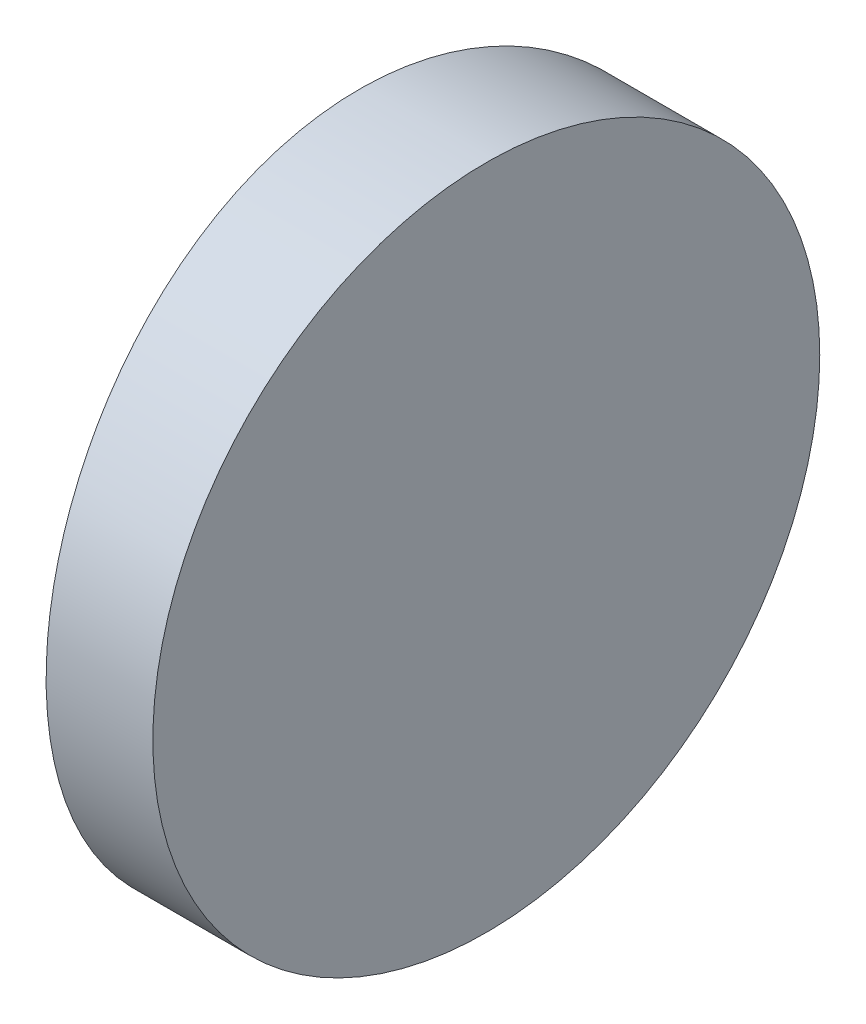
ISO-10303-21;
HEADER;
FILE_DESCRIPTION(('STEP AP214'),'2;1');
FILE_NAME('part.step','',(''),(''),'','','');
FILE_SCHEMA(('AUTOMOTIVE_DESIGN { 1 0 10303 214 1 1 1 1 }'));
ENDSEC;
DATA;
#1=APPLICATION_CONTEXT('core data for automotive mechanical design processes');
#2=APPLICATION_PROTOCOL_DEFINITION('international standard','automotive_design',2000,#1);
#3=PRODUCT_CONTEXT('',#1,'mechanical');
#4=PRODUCT('Part','Part','',(#3));
#5=PRODUCT_RELATED_PRODUCT_CATEGORY('part','',(#4));
#6=PRODUCT_DEFINITION_FORMATION('','',#4);
#7=PRODUCT_DEFINITION_CONTEXT('part definition',#1,'design');
#8=PRODUCT_DEFINITION('design','',#6,#7);
#9=PRODUCT_DEFINITION_SHAPE('','',#8);
#10=(LENGTH_UNIT() NAMED_UNIT(*) SI_UNIT(.MILLI.,.METRE.));
#11=(NAMED_UNIT(*) PLANE_ANGLE_UNIT() SI_UNIT($,.RADIAN.));
#12=(NAMED_UNIT(*) SI_UNIT($,.STERADIAN.) SOLID_ANGLE_UNIT());
#13=UNCERTAINTY_MEASURE_WITH_UNIT(LENGTH_MEASURE(1.E-05),#10,'distance_accuracy_value','');
#14=(GEOMETRIC_REPRESENTATION_CONTEXT(3) GLOBAL_UNCERTAINTY_ASSIGNED_CONTEXT((#13)) GLOBAL_UNIT_ASSIGNED_CONTEXT((#10,
#11,#12)) REPRESENTATION_CONTEXT('',''));
#15=CARTESIAN_POINT('',(0.,0.,0.));
#16=DIRECTION('',(0.,0.,1.));
#17=DIRECTION('',(1.,0.,0.));
#18=AXIS2_PLACEMENT_3D('',#15,#16,#17);
#19=CARTESIAN_POINT('',(4.35520433485127,12.5,0.));
#20=DIRECTION('',(0.,-1.,0.));
#21=DIRECTION('',(0.,0.,-1.));
#22=AXIS2_PLACEMENT_3D('',#19,#20,#21);
#23=CYLINDRICAL_SURFACE('',#22,51.68);
#24=CARTESIAN_POINT('',(-47.3247956651487,0.,0.));
#25=CARTESIAN_POINT('',(-47.3247962748539,-1.87657376567056E-06,-0.174906669645509));
#26=CARTESIAN_POINT('',(-47.3239059609,0.00734487603199729,-0.349785369305593));
#27=CARTESIAN_POINT('',(-47.3203708691074,0.036676047696006,-0.698348805374822));
#28=CARTESIAN_POINT('',(-47.3177256824529,0.0586638775502908,-0.872033254042626));
#29=CARTESIAN_POINT('',(-47.3107516572461,0.117141965164515,-1.21704271353615));
#30=CARTESIAN_POINT('',(-47.3064215199131,0.153643410673644,-1.38836579845842));
#31=CARTESIAN_POINT('',(-47.2961981459277,0.240894026508214,-1.72736463651157));
#32=CARTESIAN_POINT('',(-47.290304336173,0.291648421089333,-1.89503902792816));
#33=CARTESIAN_POINT('',(-47.2771271049913,0.406967847521387,-2.22531800216002));
#34=CARTESIAN_POINT('',(-47.269845119434,0.471518617278257,-2.38792762331963));
#35=CARTESIAN_POINT('',(-47.2540888707698,0.614021061676128,-2.70717743777051));
#36=CARTESIAN_POINT('',(-47.2456141626998,0.691977740011487,-2.86381537539246));
#37=CARTESIAN_POINT('',(-47.2277174619798,0.860663622669466,-3.16986831518064));
#38=CARTESIAN_POINT('',(-47.2182960731656,0.95138469987586,-3.31928783263471));
#39=CARTESIAN_POINT('',(-47.1987600662448,1.14503909034646,-3.61004128740635));
#40=CARTESIAN_POINT('',(-47.1886451350493,1.24797793466184,-3.75137151941614));
#41=CARTESIAN_POINT('',(-47.1679614378123,1.46580567637174,-4.0255153519705));
#42=CARTESIAN_POINT('',(-47.1573908266681,1.58074649773508,-4.15828755852108));
#43=CARTESIAN_POINT('',(-47.1361412731896,1.82132988943045,-4.41363089308497));
#44=CARTESIAN_POINT('',(-47.1254623814721,1.94696764572813,-4.53620656134385));
#45=CARTESIAN_POINT('',(-47.1042852735789,2.20820256904601,-4.77044782514803));
#46=CARTESIAN_POINT('',(-47.093787185761,2.34380647848065,-4.88210591335319));
#47=CARTESIAN_POINT('',(-47.0732800476863,2.62389983321886,-5.09359214730054));
#48=CARTESIAN_POINT('',(-47.0632708159094,2.76838593471542,-5.19342470397805));
#49=CARTESIAN_POINT('',(-47.0439830603866,3.06587091656297,-5.38097214648882));
#50=CARTESIAN_POINT('',(-47.0347075872112,3.21890124179908,-5.46863748071654));
#51=CARTESIAN_POINT('',(-47.0172013506604,3.53181009945843,-5.63071745196715));
#52=CARTESIAN_POINT('',(-47.0089702038538,3.69168608944739,-5.70513695634883));
#53=CARTESIAN_POINT('',(-46.9937923159281,4.0170785965597,-5.84016789857392));
#54=CARTESIAN_POINT('',(-46.9868445425022,4.18259045231382,-5.90079044346387));
#55=CARTESIAN_POINT('',(-46.9744277294168,4.51813759520515,-6.00784225000146));
#56=CARTESIAN_POINT('',(-46.9689583323218,4.68817177801411,-6.05427494276512));
#57=CARTESIAN_POINT('',(-46.9581400840799,5.08761265149082,-6.14539427822699));
#58=CARTESIAN_POINT('',(-46.9534112156761,5.31831233762327,-6.18458207306526));
#59=CARTESIAN_POINT('',(-46.947080076089,5.78269133175732,-6.23688359194108));
#60=CARTESIAN_POINT('',(-46.9454777837787,6.01637061961435,-6.24999749216573));
#61=CARTESIAN_POINT('',(-46.9454763208697,6.42490141151197,-6.25000187743402));
#62=CARTESIAN_POINT('',(-46.9463732197534,6.59977485271389,-6.24265556229403));
#63=CARTESIAN_POINT('',(-46.9499338694338,6.94832763015294,-6.21332618071064));
#64=CARTESIAN_POINT('',(-46.952598032015,7.12200667855671,-6.1913397030044));
#65=CARTESIAN_POINT('',(-46.9596202899006,7.46700521516011,-6.13286531527865));
#66=CARTESIAN_POINT('',(-46.9639796928088,7.6383227759744,-6.09636621062255));
#67=CARTESIAN_POINT('',(-46.9742685717104,7.97731045016011,-6.00912137160231));
#68=CARTESIAN_POINT('',(-46.9801986234784,8.1449792014945,-5.95837041232503));
#69=CARTESIAN_POINT('',(-46.9934511442764,8.47524618164766,-5.84305928171238));
#70=CARTESIAN_POINT('',(-47.0007721673958,8.63784947348723,-5.77851344149129));
#71=CARTESIAN_POINT('',(-47.0166049828427,8.95708717682365,-5.63602205206217));
#72=CARTESIAN_POINT('',(-47.0251172195852,9.11371933274545,-5.55807149936218));
#73=CARTESIAN_POINT('',(-47.0430832372052,9.41976174698812,-5.38939880534517));
#74=CARTESIAN_POINT('',(-47.0525364183052,9.56917651673221,-5.29868478466711));
#75=CARTESIAN_POINT('',(-47.0721267666286,9.85992179077867,-5.10504515470323));
#76=CARTESIAN_POINT('',(-47.0822642427497,10.001248590175,-5.00211401436884));
#77=CARTESIAN_POINT('',(-47.1029820938264,10.2753971907703,-4.78429395996451));
#78=CARTESIAN_POINT('',(-47.1135642898415,10.4081769280225,-4.66935227377387));
#79=CARTESIAN_POINT('',(-47.1348239050727,10.6635353751031,-4.42876556446081));
#80=CARTESIAN_POINT('',(-47.1455012795352,10.7861186254391,-4.30312535639076));
#81=CARTESIAN_POINT('',(-47.1666624247846,11.0203747289099,-4.04188401804455));
#82=CARTESIAN_POINT('',(-47.1771460585783,11.1320400847039,-3.9062761533584));
#83=CARTESIAN_POINT('',(-47.1976129898006,11.3435402724575,-3.62617341779464));
#84=CARTESIAN_POINT('',(-47.2075964730262,11.4433795166925,-3.48168189213455));
#85=CARTESIAN_POINT('',(-47.2268236982851,11.6309344945106,-3.18419266832472));
#86=CARTESIAN_POINT('',(-47.2360643974046,11.7186013319916,-3.03116393900715));
#87=CARTESIAN_POINT('',(-47.2534966303056,11.8806844803813,-2.7182581587774));
#88=CARTESIAN_POINT('',(-47.2616885491524,11.9551056584438,-2.55838365026649));
#89=CARTESIAN_POINT('',(-47.276788001021,12.0901400720557,-2.23299413171391));
#90=CARTESIAN_POINT('',(-47.2836965653819,12.1507644040313,-2.06748377848665));
#91=CARTESIAN_POINT('',(-47.2960394028831,12.2578198667936,-1.73193994905944));
#92=CARTESIAN_POINT('',(-47.3014740321972,12.3042544268587,-1.56190757652231));
#93=CARTESIAN_POINT('',(-47.3122216691637,12.3953819991299,-1.16245519172256));
#94=CARTESIAN_POINT('',(-47.3169176904204,12.4345744222824,-0.93174189828844));
#95=CARTESIAN_POINT('',(-47.3232042709591,12.4868820834596,-0.467335753587004));
#96=CARTESIAN_POINT('',(-47.3247948506956,12.4999974932449,-0.233642921955116));
#97=CARTESIAN_POINT('',(-47.3247962748539,12.5000018765738,0.17490666964555));
#98=CARTESIAN_POINT('',(-47.3239059609,12.492655123968,0.349785369305634));
#99=CARTESIAN_POINT('',(-47.3203708691074,12.463323952304,0.698348805374862));
#100=CARTESIAN_POINT('',(-47.3177256824529,12.4413361224497,0.872033254042665));
#101=CARTESIAN_POINT('',(-47.3107516572461,12.3828580348355,1.21704271353619));
#102=CARTESIAN_POINT('',(-47.3064215199131,12.3463565893264,1.38836579845846));
#103=CARTESIAN_POINT('',(-47.2961981459277,12.2591059734918,1.72736463651161));
#104=CARTESIAN_POINT('',(-47.290304336173,12.2083515789107,1.8950390279282));
#105=CARTESIAN_POINT('',(-47.2771271049913,12.0930321524786,2.22531800216006));
#106=CARTESIAN_POINT('',(-47.269845119434,12.0284813827217,2.38792762331967));
#107=CARTESIAN_POINT('',(-47.2540888707698,11.8859789383239,2.70717743777055));
#108=CARTESIAN_POINT('',(-47.2456141626998,11.8080222599885,2.8638153753925));
#109=CARTESIAN_POINT('',(-47.2277174619797,11.6393363773305,3.16986831518068));
#110=CARTESIAN_POINT('',(-47.2182960731656,11.5486153001241,3.31928783263475));
#111=CARTESIAN_POINT('',(-47.1987600662448,11.3549609096535,3.61004128740639));
#112=CARTESIAN_POINT('',(-47.1886451350493,11.2520220653382,3.75137151941618));
#113=CARTESIAN_POINT('',(-47.1679614378123,11.0341943236283,4.02551535197054));
#114=CARTESIAN_POINT('',(-47.1573908266681,10.9192535022649,4.15828755852112));
#115=CARTESIAN_POINT('',(-47.1361412731896,10.6786701105696,4.41363089308501));
#116=CARTESIAN_POINT('',(-47.1254623814721,10.5530323542719,4.53620656134389));
#117=CARTESIAN_POINT('',(-47.1042852735789,10.291797430954,4.77044782514807));
#118=CARTESIAN_POINT('',(-47.093787185761,10.1561935215194,4.88210591335323));
#119=CARTESIAN_POINT('',(-47.0732800476862,9.87610016678114,5.09359214730058));
#120=CARTESIAN_POINT('',(-47.0632708159094,9.73161406528459,5.19342470397809));
#121=CARTESIAN_POINT('',(-47.0439830603866,9.43412908343703,5.38097214648886));
#122=CARTESIAN_POINT('',(-47.0347075872112,9.28109875820092,5.46863748071658));
#123=CARTESIAN_POINT('',(-47.0172013506604,8.96818990054157,5.63071745196719));
#124=CARTESIAN_POINT('',(-47.0089702038538,8.80831391055261,5.70513695634887));
#125=CARTESIAN_POINT('',(-46.9937923159281,8.4829214034403,5.84016789857397));
#126=CARTESIAN_POINT('',(-46.9868445425022,8.31740954768618,5.90079044346391));
#127=CARTESIAN_POINT('',(-46.9744277294168,7.98186240479485,6.0078422500015));
#128=CARTESIAN_POINT('',(-46.9689583323218,7.81182822198589,6.05427494276516));
#129=CARTESIAN_POINT('',(-46.9581400840799,7.41238734850918,6.14539427822703));
#130=CARTESIAN_POINT('',(-46.9534112156761,7.18168766237673,6.1845820730653));
#131=CARTESIAN_POINT('',(-46.947080076089,6.71730866824268,6.23688359194112));
#132=CARTESIAN_POINT('',(-46.9454777837787,6.48362938038566,6.24999749216577));
#133=CARTESIAN_POINT('',(-46.9454763208697,6.07509858848803,6.25000187743406));
#134=CARTESIAN_POINT('',(-46.9463732197534,5.90022514728612,6.24265556229407));
#135=CARTESIAN_POINT('',(-46.9499338694338,5.55167236984707,6.21332618071068));
#136=CARTESIAN_POINT('',(-46.952598032015,5.37799332144329,6.19133970300444));
#137=CARTESIAN_POINT('',(-46.9596202899006,5.03299478483989,6.1328653152787));
#138=CARTESIAN_POINT('',(-46.9639796928088,4.8616772240256,6.09636621062259));
#139=CARTESIAN_POINT('',(-46.9742685717104,4.52268954983989,6.00912137160235));
#140=CARTESIAN_POINT('',(-46.9801986234784,4.3550207985055,5.95837041232508));
#141=CARTESIAN_POINT('',(-46.9934511442764,4.02475381835234,5.84305928171242));
#142=CARTESIAN_POINT('',(-47.0007721673958,3.86215052651278,5.77851344149133));
#143=CARTESIAN_POINT('',(-47.0166049828427,3.54291282317636,5.63602205206222));
#144=CARTESIAN_POINT('',(-47.0251172195852,3.38628066725455,5.55807149936222));
#145=CARTESIAN_POINT('',(-47.0430832372052,3.08023825301188,5.38939880534521));
#146=CARTESIAN_POINT('',(-47.0525364183052,2.93082348326779,5.29868478466715));
#147=CARTESIAN_POINT('',(-47.0721267666286,2.64007820922133,5.10504515470327));
#148=CARTESIAN_POINT('',(-47.0822642427497,2.49875140982496,5.00211401436888));
#149=CARTESIAN_POINT('',(-47.1029820938264,2.22460280922971,4.78429395996456));
#150=CARTESIAN_POINT('',(-47.1135642898415,2.0918230719775,4.66935227377391));
#151=CARTESIAN_POINT('',(-47.1348239050727,1.83646462489688,4.42876556446085));
#152=CARTESIAN_POINT('',(-47.1455012795352,1.71388137456089,4.3031253563908));
#153=CARTESIAN_POINT('',(-47.1666624247846,1.47962527109011,4.04188401804459));
#154=CARTESIAN_POINT('',(-47.1771460585783,1.36795991529606,3.90627615335843));
#155=CARTESIAN_POINT('',(-47.1976129898006,1.1564597275425,3.62617341779468));
#156=CARTESIAN_POINT('',(-47.2075964730262,1.0566204833075,3.48168189213459));
#157=CARTESIAN_POINT('',(-47.2268236982851,0.869065505489399,3.18419266832476));
#158=CARTESIAN_POINT('',(-47.2360643974046,0.781398668008389,3.03116393900719));
#159=CARTESIAN_POINT('',(-47.2534966303056,0.61931551961873,2.71825815877744));
#160=CARTESIAN_POINT('',(-47.2616885491524,0.544894341556239,2.55838365026654));
#161=CARTESIAN_POINT('',(-47.276788001021,0.409859927944295,2.23299413171395));
#162=CARTESIAN_POINT('',(-47.2836965653819,0.349235595968673,2.06748377848669));
#163=CARTESIAN_POINT('',(-47.2960394028831,0.24218013320639,1.73193994905948));
#164=CARTESIAN_POINT('',(-47.3014740321972,0.195745573141298,1.56190757652235));
#165=CARTESIAN_POINT('',(-47.3122216691637,0.104618000870127,1.1624551917226));
#166=CARTESIAN_POINT('',(-47.3169176904204,0.0654255777176143,0.931741898288478));
#167=CARTESIAN_POINT('',(-47.3232042709591,0.0131179165403716,0.467335753587044));
#168=CARTESIAN_POINT('',(-47.3247948506956,2.50675505264715E-06,0.233642921955156));
#169=CARTESIAN_POINT('',(-47.3247956651487,0.,0.));
#170=B_SPLINE_CURVE_WITH_KNOTS('',3,(#24,#25,#26,#27,#28,#29,#30,#31,#32,#33,#34,#35,#36,#37,
#38,#39,#40,#41,#42,#43,#44,#45,#46,#47,#48,#49,#50,#51,#52,#53,#54,#55,#56,#57,#58,#59,#60,#61,
#62,#63,#64,#65,#66,#67,#68,#69,#70,#71,#72,#73,#74,#75,#76,#77,#78,#79,#80,#81,#82,#83,#84,#85,
#86,#87,#88,#89,#90,#91,#92,#93,#94,#95,#96,#97,#98,#99,#100,#101,#102,#103,#104,#105,#106,#107,
#108,#109,#110,#111,#112,#113,#114,#115,#116,#117,#118,#119,#120,#121,#122,#123,#124,#125,#126,
#127,#128,#129,#130,#131,#132,#133,#134,#135,#136,#137,#138,#139,#140,#141,#142,#143,#144,#145,
#146,#147,#148,#149,#150,#151,#152,#153,#154,#155,#156,#157,#158,#159,#160,#161,#162,#163,#164,
#165,#166,#167,#168,#169),.UNSPECIFIED.,.T.,.F.,(4,2,2,2,2,2,2,2,2,2,2,2,2,2,2,2,2,2,2,2,2,2,2,
2,2,2,2,2,2,2,2,2,2,2,2,2,2,2,2,2,2,2,2,2,2,2,2,2,2,2,2,2,2,2,2,2,2,2,2,2,2,2,2,2,2,2,2,2,2,2,2,
2,4),(0.,0.52451546692041,1.04915316811638,1.57419607016871,2.09943167245511,2.62412691271252,
3.14901841983794,3.67357722732397,4.19837441782012,4.7255443017253,5.25247818030375,
5.7797718871877,6.30686828948146,6.8360519973985,7.36504084635086,7.89360232199035,
8.42203588979126,9.1226555180343,9.82327041201867,10.3477700861688,10.8723920152889,
11.3974194106908,11.9226395397388,12.4473166618237,12.9721900535981,13.4967309970374,
14.0215103279175,14.5487009931862,15.0756556288493,15.6029696206228,16.1300862497765,
16.6592625497034,17.1882439990885,17.7167984876624,18.2452251379174,18.9458852885556,
19.6465408241639,20.1710562910843,20.6956939922803,21.2207368943326,21.745972496619,
22.2706677368764,22.7955592440018,23.3201180514878,23.844915241984,24.3720851258892,
24.8990190044676,25.4263127113516,25.9534091136453,26.4825928215624,27.0115816705147,
27.5401431461542,28.0685767139551,28.7691963421982,29.4698112361825,29.9943109103327,
30.5189328394528,31.0439602348547,31.5691803639027,32.0938574859875,32.618730877762,
33.1432718212013,33.6680511520813,34.1952418173501,34.7221964530132,35.2495104447866,
35.7766270739404,36.3058033738673,36.8347848232523,37.3633393118263,37.8917659620812,
38.5924261127195,39.2930816483277),.UNSPECIFIED.);
#171=CARTESIAN_POINT('',(-47.3247956651487,0.,0.));
#172=VERTEX_POINT('',#171);
#173=EDGE_CURVE('E10',#172,#172,#170,.T.);
#174=ORIENTED_EDGE('',*,*,#173,.F.);
#175=EDGE_LOOP('',(#174));
#176=FACE_BOUND('',#175,.T.);
#177=ADVANCED_FACE('F33',(#176),#23,.T.);
#178=CARTESIAN_POINT('',(-44.9447956651487,12.5,-6.24999999999999));
#179=DIRECTION('',(1.,0.,0.));
#180=DIRECTION('',(0.,0.,-1.));
#181=AXIS2_PLACEMENT_3D('',#178,#179,#180);
#182=PLANE('',#181);
#183=CARTESIAN_POINT('',(-44.9447956651487,6.25,0.));
#184=DIRECTION('',(1.,0.,0.));
#185=DIRECTION('',(0.,0.,-1.));
#186=AXIS2_PLACEMENT_3D('',#183,#184,#185);
#187=CIRCLE('',#186,6.25);
#188=CARTESIAN_POINT('',(-44.9447956651487,6.25,-6.24999999999998));
#189=VERTEX_POINT('',#188);
#190=EDGE_CURVE('E43',#189,#189,#187,.T.);
#191=ORIENTED_EDGE('',*,*,#190,.T.);
#192=EDGE_LOOP('',(#191));
#193=FACE_BOUND('',#192,.T.);
#194=ADVANCED_FACE('F35',(#193),#182,.T.);
#195=CARTESIAN_POINT('',(-57.6447956651487,6.25,0.));
#196=DIRECTION('',(1.,0.,0.));
#197=DIRECTION('',(0.,0.,-1.));
#198=AXIS2_PLACEMENT_3D('',#195,#196,#197);
#199=CYLINDRICAL_SURFACE('',#198,6.25);
#200=ORIENTED_EDGE('',*,*,#190,.F.);
#201=EDGE_LOOP('',(#200));
#202=FACE_BOUND('',#201,.T.);
#203=ORIENTED_EDGE('',*,*,#173,.T.);
#204=EDGE_LOOP('',(#203));
#205=FACE_BOUND('',#204,.T.);
#206=ADVANCED_FACE('F50',(#202,#205),#199,.T.);
#207=CLOSED_SHELL('',(#177,#194,#206));
#208=MANIFOLD_SOLID_BREP('B2',#207);
#209=ADVANCED_BREP_SHAPE_REPRESENTATION('',(#18,#208),#14);
#210=SHAPE_DEFINITION_REPRESENTATION(#9,#209);
ENDSEC;
END-ISO-10303-21;
